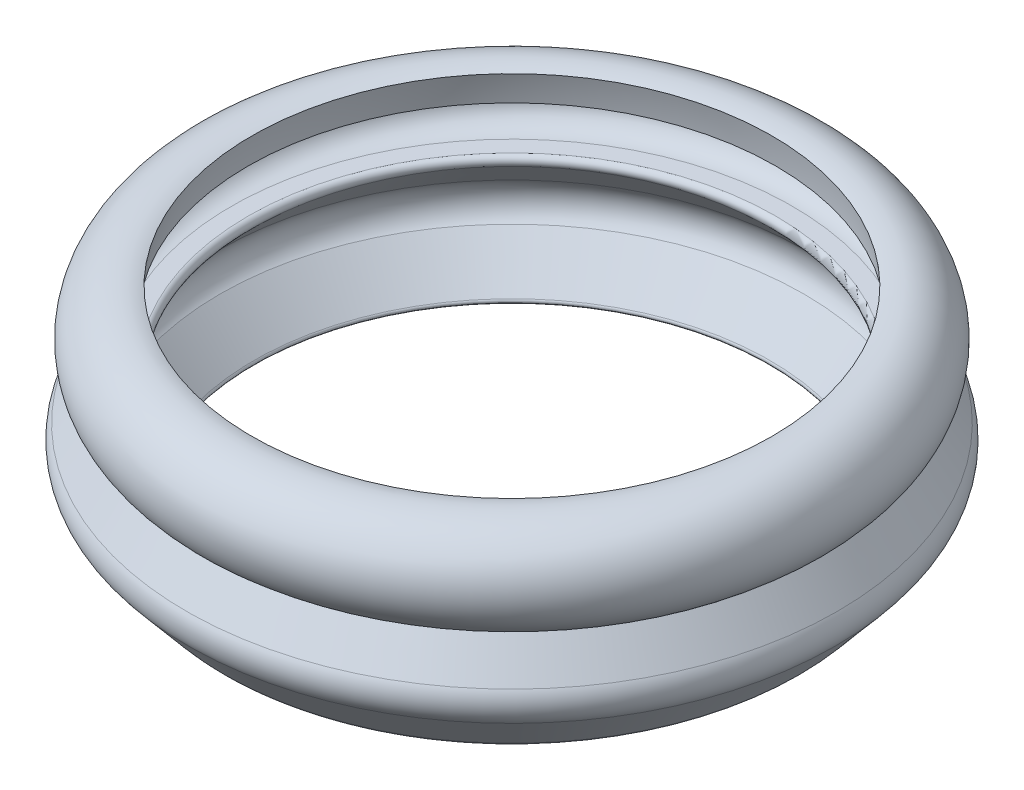
ISO-10303-21;
HEADER;
FILE_DESCRIPTION(('STEP AP214'),'2;1');
FILE_NAME('part.step','',(''),(''),'','','');
FILE_SCHEMA(('AUTOMOTIVE_DESIGN { 1 0 10303 214 1 1 1 1 }'));
ENDSEC;
DATA;
#1=APPLICATION_CONTEXT('core data for automotive mechanical design processes');
#2=APPLICATION_PROTOCOL_DEFINITION('international standard','automotive_design',2000,#1);
#3=PRODUCT_CONTEXT('',#1,'mechanical');
#4=PRODUCT('Part','Part','',(#3));
#5=PRODUCT_RELATED_PRODUCT_CATEGORY('part','',(#4));
#6=PRODUCT_DEFINITION_FORMATION('','',#4);
#7=PRODUCT_DEFINITION_CONTEXT('part definition',#1,'design');
#8=PRODUCT_DEFINITION('design','',#6,#7);
#9=PRODUCT_DEFINITION_SHAPE('','',#8);
#10=(LENGTH_UNIT() NAMED_UNIT(*) SI_UNIT(.MILLI.,.METRE.));
#11=(NAMED_UNIT(*) PLANE_ANGLE_UNIT() SI_UNIT($,.RADIAN.));
#12=(NAMED_UNIT(*) SI_UNIT($,.STERADIAN.) SOLID_ANGLE_UNIT());
#13=UNCERTAINTY_MEASURE_WITH_UNIT(LENGTH_MEASURE(1.E-05),#10,'distance_accuracy_value','');
#14=(GEOMETRIC_REPRESENTATION_CONTEXT(3) GLOBAL_UNCERTAINTY_ASSIGNED_CONTEXT((#13)) GLOBAL_UNIT_ASSIGNED_CONTEXT((#10,
#11,#12)) REPRESENTATION_CONTEXT('',''));
#15=CARTESIAN_POINT('',(0.,0.,0.));
#16=DIRECTION('',(0.,0.,1.));
#17=DIRECTION('',(1.,0.,0.));
#18=AXIS2_PLACEMENT_3D('',#15,#16,#17);
#19=CARTESIAN_POINT('',(2.54355531576951,-2.36272596021048,0.));
#20=DIRECTION('',(0.,-1.,0.));
#21=DIRECTION('',(1.,0.,0.));
#22=AXIS2_PLACEMENT_3D('',#19,#20,#21);
#23=TOROIDAL_SURFACE('',#22,5.29772043351584,0.408216514392141);
#24=CARTESIAN_POINT('',(2.54355531576951,-1.95450944581834,0.));
#25=DIRECTION('',(0.,-1.,0.));
#26=DIRECTION('',(1.,0.,0.));
#27=AXIS2_PLACEMENT_3D('',#24,#25,#26);
#28=CIRCLE('',#27,5.29772043351584);
#29=CARTESIAN_POINT('',(7.84127574928536,-1.95450944581834,0.));
#30=VERTEX_POINT('',#29);
#31=EDGE_CURVE('E81',#30,#30,#28,.T.);
#32=ORIENTED_EDGE('',*,*,#31,.F.);
#33=EDGE_LOOP('',(#32));
#34=FACE_BOUND('',#33,.T.);
#35=CARTESIAN_POINT('',(2.54355531576951,-2.77094247460262,0.));
#36=DIRECTION('',(0.,-1.,0.));
#37=DIRECTION('',(1.,0.,0.));
#38=AXIS2_PLACEMENT_3D('',#35,#36,#37);
#39=CIRCLE('',#38,5.29772043351584);
#40=CARTESIAN_POINT('',(7.84127574928536,-2.77094247460262,0.));
#41=VERTEX_POINT('',#40);
#42=EDGE_CURVE('E10',#41,#41,#39,.T.);
#43=ORIENTED_EDGE('',*,*,#42,.T.);
#44=EDGE_LOOP('',(#43));
#45=FACE_BOUND('',#44,.T.);
#46=ADVANCED_FACE('F32',(#34,#45),#23,.F.);
#47=CARTESIAN_POINT('',(-2.75416511774633,-2.77094247460262,0.));
#48=DIRECTION('',(0.,-1.,0.));
#49=DIRECTION('',(1.,0.,0.));
#50=AXIS2_PLACEMENT_3D('',#47,#48,#49);
#51=PLANE('',#50);
#52=ORIENTED_EDGE('',*,*,#42,.F.);
#53=EDGE_LOOP('',(#52));
#54=FACE_BOUND('',#53,.T.);
#55=CARTESIAN_POINT('',(2.54355531576951,-2.77094247460262,0.));
#56=DIRECTION('',(0.,-1.,0.));
#57=DIRECTION('',(1.,0.,0.));
#58=AXIS2_PLACEMENT_3D('',#55,#56,#57);
#59=CIRCLE('',#58,4.97972925426612);
#60=CARTESIAN_POINT('',(7.52328457003563,-2.77094247460262,0.));
#61=VERTEX_POINT('',#60);
#62=EDGE_CURVE('E38',#61,#61,#59,.T.);
#63=ORIENTED_EDGE('',*,*,#62,.T.);
#64=EDGE_LOOP('',(#63));
#65=FACE_BOUND('',#64,.T.);
#66=ADVANCED_FACE('F88',(#54,#65),#51,.F.);
#67=CARTESIAN_POINT('',(2.54355531576951,-2.8768726261581,0.));
#68=DIRECTION('',(0.,-1.,0.));
#69=DIRECTION('',(1.,0.,0.));
#70=AXIS2_PLACEMENT_3D('',#67,#68,#69);
#71=TOROIDAL_SURFACE('',#70,4.99736157530062,0.107387595902089);
#72=ORIENTED_EDGE('',*,*,#62,.F.);
#73=EDGE_LOOP('',(#72));
#74=FACE_BOUND('',#73,.T.);
#75=CARTESIAN_POINT('',(2.54355531576951,-2.94671465239897,0.));
#76=DIRECTION('',(0.,-1.,0.));
#77=DIRECTION('',(1.,0.,0.));
#78=AXIS2_PLACEMENT_3D('',#75,#76,#77);
#79=CIRCLE('',#78,4.91578837428338);
#80=CARTESIAN_POINT('',(7.45934369005289,-2.94671465239897,0.));
#81=VERTEX_POINT('',#80);
#82=EDGE_CURVE('E42',#81,#81,#79,.T.);
#83=ORIENTED_EDGE('',*,*,#82,.T.);
#84=EDGE_LOOP('',(#83));
#85=FACE_BOUND('',#84,.T.);
#86=ADVANCED_FACE('F92',(#74,#85),#71,.T.);
#87=CARTESIAN_POINT('',(2.54355531576951,-3.60920241815701,0.));
#88=DIRECTION('',(0.,-1.,0.));
#89=DIRECTION('',(1.,0.,0.));
#90=AXIS2_PLACEMENT_3D('',#87,#88,#89);
#91=CONICAL_SURFACE('',#90,5.53796349528914,0.754028516918881);
#92=ORIENTED_EDGE('',*,*,#82,.F.);
#93=EDGE_LOOP('',(#92));
#94=FACE_BOUND('',#93,.T.);
#95=CARTESIAN_POINT('',(2.54355531576951,-3.60920241815701,0.));
#96=DIRECTION('',(0.,-1.,0.));
#97=DIRECTION('',(1.,0.,0.));
#98=AXIS2_PLACEMENT_3D('',#95,#96,#97);
#99=CIRCLE('',#98,5.53796349528914);
#100=CARTESIAN_POINT('',(8.08151881105866,-3.60920241815701,0.));
#101=VERTEX_POINT('',#100);
#102=EDGE_CURVE('E46',#101,#101,#99,.T.);
#103=ORIENTED_EDGE('',*,*,#102,.T.);
#104=EDGE_LOOP('',(#103));
#105=FACE_BOUND('',#104,.T.);
#106=ADVANCED_FACE('F97',(#94,#105),#91,.F.);
#107=CARTESIAN_POINT('',(2.54355531576951,-3.95149283910974,0.));
#108=DIRECTION('',(0.,-1.,0.));
#109=DIRECTION('',(1.,0.,0.));
#110=AXIS2_PLACEMENT_3D('',#107,#108,#109);
#111=TOROIDAL_SURFACE('',#110,5.17349502240842,0.5);
#112=ORIENTED_EDGE('',*,*,#102,.F.);
#113=EDGE_LOOP('',(#112));
#114=FACE_BOUND('',#113,.T.);
#115=CARTESIAN_POINT('',(2.54355531576951,-4.31596131199046,0.));
#116=DIRECTION('',(0.,-1.,0.));
#117=DIRECTION('',(1.,0.,0.));
#118=AXIS2_PLACEMENT_3D('',#115,#116,#117);
#119=CIRCLE('',#118,5.51578544336115);
#120=CARTESIAN_POINT('',(8.05934075913066,-4.31596131199046,0.));
#121=VERTEX_POINT('',#120);
#122=EDGE_CURVE('E51',#121,#121,#119,.T.);
#123=ORIENTED_EDGE('',*,*,#122,.T.);
#124=EDGE_LOOP('',(#123));
#125=FACE_BOUND('',#124,.T.);
#126=ADVANCED_FACE('F103',(#114,#125),#111,.F.);
#127=CARTESIAN_POINT('',(2.54355531576951,-5.08117667649596,0.));
#128=DIRECTION('',(0.,1.,0.));
#129=DIRECTION('',(-1.,0.,0.));
#130=AXIS2_PLACEMENT_3D('',#127,#128,#129);
#131=CONICAL_SURFACE('',#130,4.8728027589737,0.698814406030689);
#132=ORIENTED_EDGE('',*,*,#122,.F.);
#133=EDGE_LOOP('',(#132));
#134=FACE_BOUND('',#133,.T.);
#135=CARTESIAN_POINT('',(2.54355531576951,-5.08117667649596,0.));
#136=DIRECTION('',(0.,-1.,0.));
#137=DIRECTION('',(1.,0.,0.));
#138=AXIS2_PLACEMENT_3D('',#135,#136,#137);
#139=CIRCLE('',#138,4.8728027589737);
#140=CARTESIAN_POINT('',(7.41635807474321,-5.08117667649596,0.));
#141=VERTEX_POINT('',#140);
#142=EDGE_CURVE('E54',#141,#141,#139,.T.);
#143=ORIENTED_EDGE('',*,*,#142,.T.);
#144=EDGE_LOOP('',(#143));
#145=FACE_BOUND('',#144,.T.);
#146=ADVANCED_FACE('F107',(#134,#145),#131,.F.);
#147=CARTESIAN_POINT('',(2.54355531576951,-5.11762352378403,0.));
#148=DIRECTION('',(0.,-1.,0.));
#149=DIRECTION('',(1.,0.,0.));
#150=AXIS2_PLACEMENT_3D('',#147,#148,#149);
#151=TOROIDAL_SURFACE('',#150,4.90703180106897,0.0499999999999997);
#152=ORIENTED_EDGE('',*,*,#142,.F.);
#153=EDGE_LOOP('',(#152));
#154=FACE_BOUND('',#153,.T.);
#155=CARTESIAN_POINT('',(2.54355531576951,-5.16762326516437,0.));
#156=DIRECTION('',(0.,-1.,0.));
#157=DIRECTION('',(1.,0.,0.));
#158=AXIS2_PLACEMENT_3D('',#155,#156,#157);
#159=CIRCLE('',#158,4.90687098471805);
#160=CARTESIAN_POINT('',(7.45042630048756,-5.16762326516437,0.));
#161=VERTEX_POINT('',#160);
#162=EDGE_CURVE('E57',#161,#161,#159,.T.);
#163=ORIENTED_EDGE('',*,*,#162,.T.);
#164=EDGE_LOOP('',(#163));
#165=FACE_BOUND('',#164,.T.);
#166=ADVANCED_FACE('F111',(#154,#165),#151,.T.);
#167=CARTESIAN_POINT('',(2.54355531576951,-5.1685881632699,0.));
#168=DIRECTION('',(0.,-1.,0.));
#169=DIRECTION('',(1.,0.,0.));
#170=AXIS2_PLACEMENT_3D('',#167,#168,#169);
#171=CONICAL_SURFACE('',#170,5.20686943300011,1.56757999423111);
#172=ORIENTED_EDGE('',*,*,#162,.F.);
#173=EDGE_LOOP('',(#172));
#174=FACE_BOUND('',#173,.T.);
#175=CARTESIAN_POINT('',(2.54355531576951,-5.1685881632699,0.));
#176=DIRECTION('',(0.,-1.,0.));
#177=DIRECTION('',(1.,0.,0.));
#178=AXIS2_PLACEMENT_3D('',#175,#176,#177);
#179=CIRCLE('',#178,5.20686943300011);
#180=CARTESIAN_POINT('',(7.75042474876963,-5.1685881632699,0.));
#181=VERTEX_POINT('',#180);
#182=EDGE_CURVE('E60',#181,#181,#179,.T.);
#183=ORIENTED_EDGE('',*,*,#182,.T.);
#184=EDGE_LOOP('',(#183));
#185=FACE_BOUND('',#184,.T.);
#186=ADVANCED_FACE('F115',(#174,#185),#171,.F.);
#187=CARTESIAN_POINT('',(2.54355531576951,-4.86858971498783,0.));
#188=DIRECTION('',(0.,-1.,0.));
#189=DIRECTION('',(1.,0.,0.));
#190=AXIS2_PLACEMENT_3D('',#187,#188,#189);
#191=TOROIDAL_SURFACE('',#190,5.20783433110564,0.300000000000001);
#192=ORIENTED_EDGE('',*,*,#182,.F.);
#193=EDGE_LOOP('',(#192));
#194=FACE_BOUND('',#193,.T.);
#195=CARTESIAN_POINT('',(2.54355531576951,-5.06166503964967,0.));
#196=DIRECTION('',(0.,-1.,0.));
#197=DIRECTION('',(1.,0.,0.));
#198=AXIS2_PLACEMENT_3D('',#195,#196,#197);
#199=CIRCLE('',#198,5.43744687215409);
#200=CARTESIAN_POINT('',(7.9810021879236,-5.06166503964967,0.));
#201=VERTEX_POINT('',#200);
#202=EDGE_CURVE('E63',#201,#201,#199,.T.);
#203=ORIENTED_EDGE('',*,*,#202,.T.);
#204=EDGE_LOOP('',(#203));
#205=FACE_BOUND('',#204,.T.);
#206=ADVANCED_FACE('F119',(#194,#205),#191,.T.);
#207=CARTESIAN_POINT('',(2.54355531576951,-4.26328912270486,0.));
#208=DIRECTION('',(0.,1.,0.));
#209=DIRECTION('',(-1.,0.,0.));
#210=AXIS2_PLACEMENT_3D('',#207,#208,#209);
#211=CONICAL_SURFACE('',#210,6.10878080131341,0.699172311472239);
#212=ORIENTED_EDGE('',*,*,#202,.F.);
#213=EDGE_LOOP('',(#212));
#214=FACE_BOUND('',#213,.T.);
#215=CARTESIAN_POINT('',(2.54355531576951,-4.26328912270486,0.));
#216=DIRECTION('',(0.,-1.,0.));
#217=DIRECTION('',(1.,0.,0.));
#218=AXIS2_PLACEMENT_3D('',#215,#216,#217);
#219=CIRCLE('',#218,6.10878080131341);
#220=CARTESIAN_POINT('',(8.65233611708293,-4.26328912270486,0.));
#221=VERTEX_POINT('',#220);
#222=EDGE_CURVE('E66',#221,#221,#219,.T.);
#223=ORIENTED_EDGE('',*,*,#222,.T.);
#224=EDGE_LOOP('',(#223));
#225=FACE_BOUND('',#224,.T.);
#226=ADVANCED_FACE('F123',(#214,#225),#211,.T.);
#227=CARTESIAN_POINT('',(2.54355531576951,-3.94149691493513,0.));
#228=DIRECTION('',(0.,-1.,0.));
#229=DIRECTION('',(1.,0.,0.));
#230=AXIS2_PLACEMENT_3D('',#227,#228,#229);
#231=TOROIDAL_SURFACE('',#230,5.72609323289934,0.5);
#232=ORIENTED_EDGE('',*,*,#222,.F.);
#233=EDGE_LOOP('',(#232));
#234=FACE_BOUND('',#233,.T.);
#235=CARTESIAN_POINT('',(2.54355531576951,-3.67470303410351,0.));
#236=DIRECTION('',(0.,-1.,0.));
#237=DIRECTION('',(1.,0.,0.));
#238=AXIS2_PLACEMENT_3D('',#235,#236,#237);
#239=CIRCLE('',#238,6.14896558379355);
#240=CARTESIAN_POINT('',(8.69252089956307,-3.67470303410351,0.));
#241=VERTEX_POINT('',#240);
#242=EDGE_CURVE('E69',#241,#241,#239,.T.);
#243=ORIENTED_EDGE('',*,*,#242,.T.);
#244=EDGE_LOOP('',(#243));
#245=FACE_BOUND('',#244,.T.);
#246=ADVANCED_FACE('F127',(#234,#245),#231,.T.);
#247=CARTESIAN_POINT('',(2.54355531576951,-3.02547564672074,0.));
#248=DIRECTION('',(0.,-1.,0.));
#249=DIRECTION('',(1.,0.,0.));
#250=AXIS2_PLACEMENT_3D('',#247,#248,#249);
#251=CONICAL_SURFACE('',#250,5.7393623220628,0.562837049494487);
#252=ORIENTED_EDGE('',*,*,#242,.F.);
#253=EDGE_LOOP('',(#252));
#254=FACE_BOUND('',#253,.T.);
#255=CARTESIAN_POINT('',(2.54355531576951,-3.02547564672074,0.));
#256=DIRECTION('',(0.,-1.,0.));
#257=DIRECTION('',(1.,0.,0.));
#258=AXIS2_PLACEMENT_3D('',#255,#256,#257);
#259=CIRCLE('',#258,5.7393623220628);
#260=CARTESIAN_POINT('',(8.28291763783232,-3.02547564672074,0.));
#261=VERTEX_POINT('',#260);
#262=EDGE_CURVE('E72',#261,#261,#259,.T.);
#263=ORIENTED_EDGE('',*,*,#262,.T.);
#264=EDGE_LOOP('',(#263));
#265=FACE_BOUND('',#264,.T.);
#266=ADVANCED_FACE('F131',(#254,#265),#251,.T.);
#267=CARTESIAN_POINT('',(2.54355531576951,-2.29378971709662,0.));
#268=DIRECTION('',(0.,-1.,0.));
#269=DIRECTION('',(1.,0.,0.));
#270=AXIS2_PLACEMENT_3D('',#267,#268,#269);
#271=TOROIDAL_SURFACE('',#270,5.19816063461645,0.910089867048683);
#272=ORIENTED_EDGE('',*,*,#262,.F.);
#273=EDGE_LOOP('',(#272));
#274=FACE_BOUND('',#273,.T.);
#275=CARTESIAN_POINT('',(2.54355531576951,-1.4289672441157,0.));
#276=DIRECTION('',(0.,-1.,0.));
#277=DIRECTION('',(1.,0.,0.));
#278=AXIS2_PLACEMENT_3D('',#275,#276,#277);
#279=CIRCLE('',#278,4.91470754090984);
#280=CARTESIAN_POINT('',(7.45826285667936,-1.4289672441157,0.));
#281=VERTEX_POINT('',#280);
#282=EDGE_CURVE('E75',#281,#281,#279,.T.);
#283=ORIENTED_EDGE('',*,*,#282,.T.);
#284=EDGE_LOOP('',(#283));
#285=FACE_BOUND('',#284,.T.);
#286=ADVANCED_FACE('F135',(#274,#285),#271,.T.);
#287=CARTESIAN_POINT('',(2.54355531576951,-2.32959618828186,0.));
#288=DIRECTION('',(0.,-1.,0.));
#289=DIRECTION('',(1.,0.,0.));
#290=AXIS2_PLACEMENT_3D('',#287,#288,#289);
#291=DEGENERATE_TOROIDAL_SURFACE('',#290,0.00351037872493766,5.00000000000865,.F.);
#292=ORIENTED_EDGE('',*,*,#282,.F.);
#293=EDGE_LOOP('',(#292));
#294=FACE_BOUND('',#293,.T.);
#295=CARTESIAN_POINT('',(2.54355531576951,-1.95450944581834,0.));
#296=DIRECTION('',(0.,-1.,0.));
#297=DIRECTION('',(1.,0.,0.));
#298=AXIS2_PLACEMENT_3D('',#295,#296,#297);
#299=CIRCLE('',#298,4.98240076526017);
#300=CARTESIAN_POINT('',(7.52595608102968,-1.95450944581834,0.));
#301=VERTEX_POINT('',#300);
#302=EDGE_CURVE('E78',#301,#301,#299,.T.);
#303=ORIENTED_EDGE('',*,*,#302,.T.);
#304=EDGE_LOOP('',(#303));
#305=FACE_BOUND('',#304,.T.);
#306=ADVANCED_FACE('F139',(#294,#305),#291,.T.);
#307=CARTESIAN_POINT('',(-2.75416511774633,-1.95450944581834,0.));
#308=DIRECTION('',(0.,1.,0.));
#309=DIRECTION('',(-1.,0.,0.));
#310=AXIS2_PLACEMENT_3D('',#307,#308,#309);
#311=PLANE('',#310);
#312=ORIENTED_EDGE('',*,*,#302,.F.);
#313=EDGE_LOOP('',(#312));
#314=FACE_BOUND('',#313,.T.);
#315=ORIENTED_EDGE('',*,*,#31,.T.);
#316=EDGE_LOOP('',(#315));
#317=FACE_BOUND('',#316,.T.);
#318=ADVANCED_FACE('F85',(#314,#317),#311,.F.);
#319=CLOSED_SHELL('',(#46,#66,#86,#106,#126,#146,#166,#186,#206,#226,#246,#266,#286,#306,#318));
#320=MANIFOLD_SOLID_BREP('B2',#319);
#321=ADVANCED_BREP_SHAPE_REPRESENTATION('',(#18,#320),#14);
#322=SHAPE_DEFINITION_REPRESENTATION(#9,#321);
ENDSEC;
END-ISO-10303-21;
